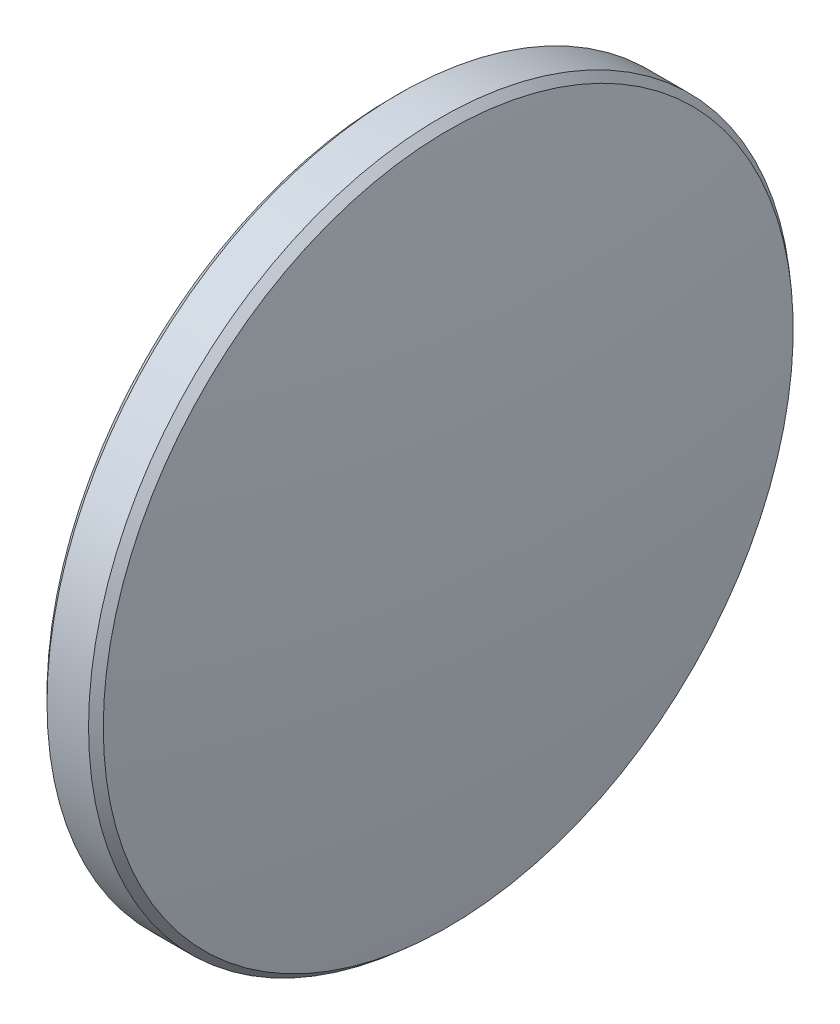
ISO-10303-21;
HEADER;
FILE_DESCRIPTION(('STEP AP214'),'2;1');
FILE_NAME('part.step','',(''),(''),'','','');
FILE_SCHEMA(('AUTOMOTIVE_DESIGN { 1 0 10303 214 1 1 1 1 }'));
ENDSEC;
DATA;
#1=APPLICATION_CONTEXT('core data for automotive mechanical design processes');
#2=APPLICATION_PROTOCOL_DEFINITION('international standard','automotive_design',2000,#1);
#3=PRODUCT_CONTEXT('',#1,'mechanical');
#4=PRODUCT('Part','Part','',(#3));
#5=PRODUCT_RELATED_PRODUCT_CATEGORY('part','',(#4));
#6=PRODUCT_DEFINITION_FORMATION('','',#4);
#7=PRODUCT_DEFINITION_CONTEXT('part definition',#1,'design');
#8=PRODUCT_DEFINITION('design','',#6,#7);
#9=PRODUCT_DEFINITION_SHAPE('','',#8);
#10=(LENGTH_UNIT() NAMED_UNIT(*) SI_UNIT(.MILLI.,.METRE.));
#11=(NAMED_UNIT(*) PLANE_ANGLE_UNIT() SI_UNIT($,.RADIAN.));
#12=(NAMED_UNIT(*) SI_UNIT($,.STERADIAN.) SOLID_ANGLE_UNIT());
#13=UNCERTAINTY_MEASURE_WITH_UNIT(LENGTH_MEASURE(1.E-05),#10,'distance_accuracy_value','');
#14=(GEOMETRIC_REPRESENTATION_CONTEXT(3) GLOBAL_UNCERTAINTY_ASSIGNED_CONTEXT((#13)) GLOBAL_UNIT_ASSIGNED_CONTEXT((#10,
#11,#12)) REPRESENTATION_CONTEXT('',''));
#15=CARTESIAN_POINT('',(0.,0.,0.));
#16=DIRECTION('',(0.,0.,1.));
#17=DIRECTION('',(1.,0.,0.));
#18=AXIS2_PLACEMENT_3D('',#15,#16,#17);
#19=CARTESIAN_POINT('',(-1.45,0.,0.));
#20=DIRECTION('',(1.,0.,0.));
#21=DIRECTION('',(0.,0.,-1.));
#22=AXIS2_PLACEMENT_3D('',#19,#20,#21);
#23=PLANE('',#22);
#24=CARTESIAN_POINT('',(-1.45,0.,0.));
#25=DIRECTION('',(1.,0.,0.));
#26=DIRECTION('',(0.,0.,-1.));
#27=AXIS2_PLACEMENT_3D('',#24,#25,#26);
#28=CIRCLE('',#27,12.45);
#29=CARTESIAN_POINT('',(-1.45,0.,-12.45));
#30=VERTEX_POINT('',#29);
#31=EDGE_CURVE('E10',#30,#30,#28,.F.);
#32=ORIENTED_EDGE('',*,*,#31,.T.);
#33=EDGE_LOOP('',(#32));
#34=FACE_BOUND('',#33,.T.);
#35=ADVANCED_FACE('F15',(#34),#23,.F.);
#36=CARTESIAN_POINT('',(-1.45,0.,0.));
#37=DIRECTION('',(-1.,0.,0.));
#38=DIRECTION('',(0.,0.,1.));
#39=AXIS2_PLACEMENT_3D('',#36,#37,#38);
#40=CYLINDRICAL_SURFACE('',#39,12.7);
#41=CARTESIAN_POINT('',(0.299999999999689,0.,0.));
#42=DIRECTION('',(-1.,0.,0.));
#43=DIRECTION('',(0.,0.,1.));
#44=AXIS2_PLACEMENT_3D('',#41,#42,#43);
#45=CIRCLE('',#44,12.7);
#46=CARTESIAN_POINT('',(0.299999999999689,0.,12.7));
#47=VERTEX_POINT('',#46);
#48=EDGE_CURVE('E55',#47,#47,#45,.T.);
#49=ORIENTED_EDGE('',*,*,#48,.T.);
#50=EDGE_LOOP('',(#49));
#51=FACE_BOUND('',#50,.T.);
#52=CARTESIAN_POINT('',(-1.20000000000001,0.,0.));
#53=DIRECTION('',(1.,0.,0.));
#54=DIRECTION('',(0.,0.,-1.));
#55=AXIS2_PLACEMENT_3D('',#52,#53,#54);
#56=CIRCLE('',#55,12.7);
#57=CARTESIAN_POINT('',(-1.20000000000001,0.,-12.7));
#58=VERTEX_POINT('',#57);
#59=EDGE_CURVE('E53',#58,#58,#56,.T.);
#60=ORIENTED_EDGE('',*,*,#59,.T.);
#61=EDGE_LOOP('',(#60));
#62=FACE_BOUND('',#61,.T.);
#63=ADVANCED_FACE('F28',(#51,#62),#40,.T.);
#64=CARTESIAN_POINT('',(-90.5498968177526,0.,-0.137787963462782));
#65=DIRECTION('',(0.,-1.,0.));
#66=DIRECTION('',(0.,0.,1.));
#67=AXIS2_PLACEMENT_3D('',#64,#65,#66);
#68=CIRCLE('',#67,92.);
#69=TRIMMED_CURVE('',#68,(PARAMETER_VALUE(-1.56929863097995)),
(PARAMETER_VALUE(1.56929863097995)),.T.,.PARAMETER.);
#70=CARTESIAN_POINT('',(-90.5498968177526,0.,0.));
#71=DIRECTION('',(-1.,0.,0.));
#72=AXIS1_PLACEMENT('',#70,#71);
#73=SURFACE_OF_REVOLUTION('',#69,#72);
#74=CARTESIAN_POINT('',(0.584495613470598,0.,0.));
#75=DIRECTION('',(-1.,0.,0.));
#76=DIRECTION('',(0.,0.,1.));
#77=AXIS2_PLACEMENT_3D('',#74,#75,#76);
#78=CIRCLE('',#77,12.4527845490088);
#79=CARTESIAN_POINT('',(0.584495613470598,0.,12.4527845490088));
#80=VERTEX_POINT('',#79);
#81=EDGE_CURVE('E22',#80,#80,#78,.F.);
#82=ORIENTED_EDGE('',*,*,#81,.T.);
#83=EDGE_LOOP('',(#82));
#84=FACE_BOUND('',#83,.T.);
#85=CARTESIAN_POINT('',(1.45,0.,0.));
#86=VERTEX_POINT('',#85);
#87=VERTEX_LOOP('',#86);
#88=FACE_BOUND('',#87,.T.);
#89=ADVANCED_FACE('F25',(#84,#88),#73,.T.);
#90=CARTESIAN_POINT('',(0.299999999999689,0.,0.));
#91=DIRECTION('',(-1.,0.,0.));
#92=DIRECTION('',(0.,0.,1.));
#93=AXIS2_PLACEMENT_3D('',#90,#91,#92);
#94=CONICAL_SURFACE('',#93,12.7,0.715399143551326);
#95=ORIENTED_EDGE('',*,*,#81,.F.);
#96=EDGE_LOOP('',(#95));
#97=FACE_BOUND('',#96,.T.);
#98=ORIENTED_EDGE('',*,*,#48,.F.);
#99=EDGE_LOOP('',(#98));
#100=FACE_BOUND('',#99,.T.);
#101=ADVANCED_FACE('F27',(#97,#100),#94,.T.);
#102=CARTESIAN_POINT('',(-1.45,0.,0.));
#103=DIRECTION('',(1.,0.,0.));
#104=DIRECTION('',(0.,0.,-1.));
#105=AXIS2_PLACEMENT_3D('',#102,#103,#104);
#106=CONICAL_SURFACE('',#105,12.45,0.785398163397441);
#107=ORIENTED_EDGE('',*,*,#59,.F.);
#108=EDGE_LOOP('',(#107));
#109=FACE_BOUND('',#108,.T.);
#110=ORIENTED_EDGE('',*,*,#31,.F.);
#111=EDGE_LOOP('',(#110));
#112=FACE_BOUND('',#111,.T.);
#113=ADVANCED_FACE('F17',(#109,#112),#106,.T.);
#114=CLOSED_SHELL('',(#35,#63,#89,#101,#113));
#115=MANIFOLD_SOLID_BREP('B1',#114);
#116=ADVANCED_BREP_SHAPE_REPRESENTATION('',(#18,#115),#14);
#117=SHAPE_DEFINITION_REPRESENTATION(#9,#116);
ENDSEC;
END-ISO-10303-21;
